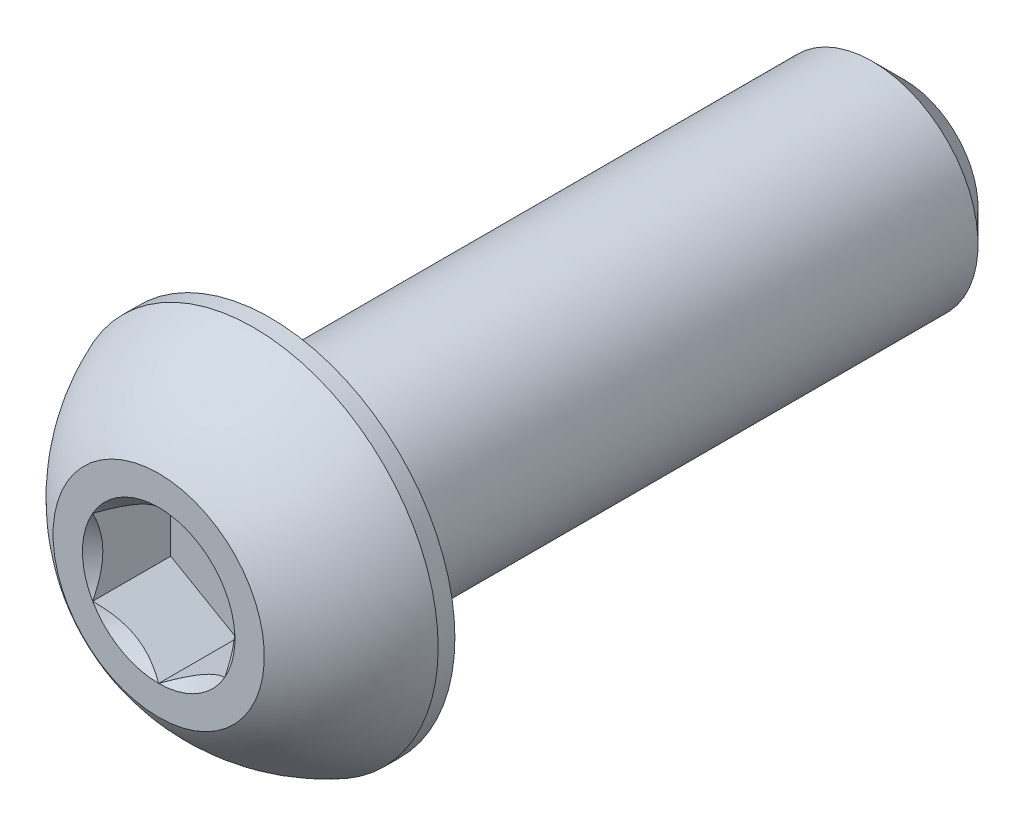
ISO-10303-21;
HEADER;
FILE_DESCRIPTION(('STEP AP214'),'2;1');
FILE_NAME('part.step','',(''),(''),'','','');
FILE_SCHEMA(('AUTOMOTIVE_DESIGN { 1 0 10303 214 1 1 1 1 }'));
ENDSEC;
DATA;
#1=APPLICATION_CONTEXT('core data for automotive mechanical design processes');
#2=APPLICATION_PROTOCOL_DEFINITION('international standard','automotive_design',2000,#1);
#3=PRODUCT_CONTEXT('',#1,'mechanical');
#4=PRODUCT('Part','Part','',(#3));
#5=PRODUCT_RELATED_PRODUCT_CATEGORY('part','',(#4));
#6=PRODUCT_DEFINITION_FORMATION('','',#4);
#7=PRODUCT_DEFINITION_CONTEXT('part definition',#1,'design');
#8=PRODUCT_DEFINITION('design','',#6,#7);
#9=PRODUCT_DEFINITION_SHAPE('','',#8);
#10=(LENGTH_UNIT() NAMED_UNIT(*) SI_UNIT(.MILLI.,.METRE.));
#11=(NAMED_UNIT(*) PLANE_ANGLE_UNIT() SI_UNIT($,.RADIAN.));
#12=(NAMED_UNIT(*) SI_UNIT($,.STERADIAN.) SOLID_ANGLE_UNIT());
#13=UNCERTAINTY_MEASURE_WITH_UNIT(LENGTH_MEASURE(1.E-05),#10,'distance_accuracy_value','');
#14=(GEOMETRIC_REPRESENTATION_CONTEXT(3) GLOBAL_UNCERTAINTY_ASSIGNED_CONTEXT((#13)) GLOBAL_UNIT_ASSIGNED_CONTEXT((#10,
#11,#12)) REPRESENTATION_CONTEXT('',''));
#15=CARTESIAN_POINT('',(0.,0.,0.));
#16=DIRECTION('',(0.,0.,1.));
#17=DIRECTION('',(1.,0.,0.));
#18=AXIS2_PLACEMENT_3D('',#15,#16,#17);
#19=CARTESIAN_POINT('',(0.,-3.175,-22.4028));
#20=DIRECTION('',(0.,0.,-1.));
#21=DIRECTION('',(0.,1.,0.));
#22=AXIS2_PLACEMENT_3D('',#19,#20,#21);
#23=PLANE('',#22);
#24=CARTESIAN_POINT('',(0.,0.,-22.4028));
#25=DIRECTION('',(0.,0.,-1.));
#26=DIRECTION('',(0.,1.,0.));
#27=AXIS2_PLACEMENT_3D('',#24,#25,#26);
#28=CIRCLE('',#27,2.22250000000001);
#29=CARTESIAN_POINT('',(0.,2.22250000000001,-22.4028));
#30=VERTEX_POINT('',#29);
#31=EDGE_CURVE('E177',#30,#30,#28,.T.);
#32=ORIENTED_EDGE('',*,*,#31,.T.);
#33=EDGE_LOOP('',(#32));
#34=FACE_BOUND('',#33,.T.);
#35=ADVANCED_FACE('F37',(#34),#23,.T.);
#36=CARTESIAN_POINT('',(0.,0.,-22.4028));
#37=DIRECTION('',(0.,0.,-1.));
#38=DIRECTION('',(0.,1.,0.));
#39=AXIS2_PLACEMENT_3D('',#36,#37,#38);
#40=CYLINDRICAL_SURFACE('',#39,3.175);
#41=CARTESIAN_POINT('',(0.,0.,-21.4503));
#42=DIRECTION('',(0.,0.,-1.));
#43=DIRECTION('',(0.,1.,0.));
#44=AXIS2_PLACEMENT_3D('',#41,#42,#43);
#45=CIRCLE('',#44,3.175);
#46=CARTESIAN_POINT('',(0.,3.175,-21.4503));
#47=VERTEX_POINT('',#46);
#48=EDGE_CURVE('E51',#47,#47,#45,.F.);
#49=ORIENTED_EDGE('',*,*,#48,.T.);
#50=EDGE_LOOP('',(#49));
#51=FACE_BOUND('',#50,.T.);
#52=CARTESIAN_POINT('',(0.,0.,-3.3528));
#53=DIRECTION('',(0.,0.,1.));
#54=DIRECTION('',(1.,0.,0.));
#55=AXIS2_PLACEMENT_3D('',#52,#53,#54);
#56=CIRCLE('',#55,3.175);
#57=CARTESIAN_POINT('',(3.175,0.,-3.3528));
#58=VERTEX_POINT('',#57);
#59=EDGE_CURVE('E174',#58,#58,#56,.F.);
#60=ORIENTED_EDGE('',*,*,#59,.T.);
#61=EDGE_LOOP('',(#60));
#62=FACE_BOUND('',#61,.T.);
#63=ADVANCED_FACE('F182',(#51,#62),#40,.T.);
#64=CARTESIAN_POINT('',(0.,0.,-22.4028));
#65=DIRECTION('',(0.,0.,1.));
#66=DIRECTION('',(0.,-1.,0.));
#67=AXIS2_PLACEMENT_3D('',#64,#65,#66);
#68=CONICAL_SURFACE('',#67,2.22250000000001,0.785398163397448);
#69=ORIENTED_EDGE('',*,*,#48,.F.);
#70=EDGE_LOOP('',(#69));
#71=FACE_BOUND('',#70,.T.);
#72=ORIENTED_EDGE('',*,*,#31,.F.);
#73=EDGE_LOOP('',(#72));
#74=FACE_BOUND('',#73,.T.);
#75=ADVANCED_FACE('F39',(#71,#74),#68,.T.);
#76=CARTESIAN_POINT('',(0.,0.,-5.060315));
#77=DIRECTION('',(0.,0.,1.));
#78=DIRECTION('',(0.,-1.,0.));
#79=AXIS2_PLACEMENT_3D('',#76,#77,#78);
#80=SPHERICAL_SURFACE('',#79,5.97389428256184);
#81=CARTESIAN_POINT('',(0.,0.,0.));
#82=DIRECTION('',(0.,0.,1.));
#83=DIRECTION('',(1.,0.,0.));
#84=AXIS2_PLACEMENT_3D('',#81,#82,#83);
#85=CIRCLE('',#84,3.175);
#86=CARTESIAN_POINT('',(0.,-3.175,0.));
#87=VERTEX_POINT('',#86);
#88=EDGE_CURVE('E171',#87,#87,#85,.T.);
#89=CARTESIAN_POINT('',(0.,0.,-2.84988));
#90=DIRECTION('',(0.,0.,1.));
#91=DIRECTION('',(1.,0.,0.));
#92=AXIS2_PLACEMENT_3D('',#89,#90,#91);
#93=CIRCLE('',#92,5.5499);
#94=CARTESIAN_POINT('',(0.,-5.5499,-2.84988));
#95=VERTEX_POINT('',#94);
#96=EDGE_CURVE('E165',#95,#95,#93,.T.);
#97=CARTESIAN_POINT('',(0.,-3.175,0.));
#98=CARTESIAN_POINT('',(0.,-3.20828343957184,-0.0208830076580502));
#99=CARTESIAN_POINT('',(0.,-3.24136078860705,-0.0420944789280503));
#100=CARTESIAN_POINT('',(0.,-3.30709055775141,-0.0851658910984718));
#101=CARTESIAN_POINT('',(0.,-3.33974297786056,-0.107025831998893));
#102=CARTESIAN_POINT('',(0.,-3.40461014130008,-0.151385725836676));
#103=CARTESIAN_POINT('',(0.,-3.43682488463043,-0.173885678774039));
#104=CARTESIAN_POINT('',(0.,-3.50080416139461,-0.219516822259479));
#105=CARTESIAN_POINT('',(0.,-3.53256869482844,-0.242648012807557));
#106=CARTESIAN_POINT('',(0.,-3.59563518208834,-0.289532629449102));
#107=CARTESIAN_POINT('',(0.,-3.62693713591442,-0.313286055542569));
#108=CARTESIAN_POINT('',(0.,-3.68906627753106,-0.36140589409133));
#109=CARTESIAN_POINT('',(0.,-3.71989346532163,-0.385772306546626));
#110=CARTESIAN_POINT('',(0.,-3.78106107243204,-0.435108631276877));
#111=CARTESIAN_POINT('',(0.,-3.8114014917519,-0.460078543551833));
#112=CARTESIAN_POINT('',(0.,-3.87158374923259,-0.510612146063938));
#113=CARTESIAN_POINT('',(0.,-3.90142558739343,-0.536175836301086));
#114=CARTESIAN_POINT('',(0.,-3.96059906392414,-0.587887041792083));
#115=CARTESIAN_POINT('',(0.,-3.989930702294,-0.614034557045931));
#116=CARTESIAN_POINT('',(0.,-4.04807235926832,-0.666903232293407));
#117=CARTESIAN_POINT('',(0.,-4.07688237787279,-0.693624392287034));
#118=CARTESIAN_POINT('',(0.,-4.13396957842491,-0.747629953401057));
#119=CARTESIAN_POINT('',(0.,-4.16224676037257,-0.774914354521453));
#120=CARTESIAN_POINT('',(0.,-4.21825727817542,-0.830035774981947));
#121=CARTESIAN_POINT('',(0.,-4.24599061403061,-0.857872794322045));
#122=CARTESIAN_POINT('',(0.,-4.30090264195357,-0.91408861315902));
#123=CARTESIAN_POINT('',(0.,-4.32808133402134,-0.942467412655899));
#124=CARTESIAN_POINT('',(0.,-4.38187349261953,-0.999755742806741));
#125=CARTESIAN_POINT('',(0.,-4.40848695914995,-1.0286652734607));
#126=CARTESIAN_POINT('',(0.,-4.46113830498838,-1.08700381029123));
#127=CARTESIAN_POINT('',(0.,-4.48717618429639,-1.11643281646778));
#128=CARTESIAN_POINT('',(0.,-4.53866621810402,-1.17579884645643));
#129=CARTESIAN_POINT('',(0.,-4.56411837260364,-1.20573587026853));
#130=CARTESIAN_POINT('',(0.,-4.61442704725457,-1.26610627984964));
#131=CARTESIAN_POINT('',(0.,-4.63928356740587,-1.29653966561866));
#132=CARTESIAN_POINT('',(0.,-4.68839129572448,-1.3578909501815));
#133=CARTESIAN_POINT('',(0.,-4.71264250389178,-1.38880884897531));
#134=CARTESIAN_POINT('',(0.,-4.76053016627881,-1.45111712201534));
#135=CARTESIAN_POINT('',(0.,-4.78416662049853,-1.48250749626155));
#136=CARTESIAN_POINT('',(0.,-4.8308155723751,-1.54574849868041));
#137=CARTESIAN_POINT('',(0.,-4.85382807003194,-1.57759912685306));
#138=CARTESIAN_POINT('',(0.,-4.89922014909859,-1.64174823640362));
#139=CARTESIAN_POINT('',(0.,-4.92159973050841,-1.67404671778154));
#140=CARTESIAN_POINT('',(0.,-4.96571726381658,-1.73907895865427));
#141=CARTESIAN_POINT('',(0.,-4.98745521571493,-1.77181271814908));
#142=CARTESIAN_POINT('',(0.,-5.03028102654719,-1.83770277069632));
#143=CARTESIAN_POINT('',(0.,-5.0513688854811,-1.87085906374874));
#144=CARTESIAN_POINT('',(0.,-5.09288630004063,-1.93758127434189));
#145=CARTESIAN_POINT('',(0.,-5.11331585566624,-1.97114719188261));
#146=CARTESIAN_POINT('',(0.,-5.15350870956168,-2.03867558290299));
#147=CARTESIAN_POINT('',(0.,-5.17327200783151,-2.07263805638265));
#148=CARTESIAN_POINT('',(0.,-5.21212465239608,-2.14094633632486));
#149=CARTESIAN_POINT('',(0.,-5.23121399869082,-2.17529214278741));
#150=CARTESIAN_POINT('',(0.,-5.26871130697935,-2.2443537165359));
#151=CARTESIAN_POINT('',(0.,-5.28711926897315,-2.27906948382184));
#152=CARTESIAN_POINT('',(0.,-5.32324664200827,-2.3488574628552));
#153=CARTESIAN_POINT('',(0.,-5.3409660530496,-2.38392967460262));
#154=CARTESIAN_POINT('',(0.,-5.37570942417474,-2.45441688802313));
#155=CARTESIAN_POINT('',(0.,-5.39273338425856,-2.48983188969622));
#156=CARTESIAN_POINT('',(0.,-5.42607922958184,-2.56099089271574));
#157=CARTESIAN_POINT('',(0.,-5.44240111482132,-2.59673489406217));
#158=CARTESIAN_POINT('',(0.,-5.47433643994316,-2.66853798649801));
#159=CARTESIAN_POINT('',(0.,-5.48994987982553,-2.70459707758742));
#160=CARTESIAN_POINT('',(0.,-5.52046229408188,-2.77701628549785));
#161=CARTESIAN_POINT('',(0.,-5.53536126845586,-2.81337640231887));
#162=CARTESIAN_POINT('',(0.,-5.5499,-2.84988));
#163=B_SPLINE_CURVE_WITH_KNOTS('',3,(#97,#98,#99,#100,#101,#102,#103,#104,#105,#106,#107,#108,
#109,#110,#111,#112,#113,#114,#115,#116,#117,#118,#119,#120,#121,#122,#123,#124,#125,#126,#127,
#128,#129,#130,#131,#132,#133,#134,#135,#136,#137,#138,#139,#140,#141,#142,#143,#144,#145,#146,
#147,#148,#149,#150,#151,#152,#153,#154,#155,#156,#157,#158,#159,#160,#161,#162),.UNSPECIFIED.,
.F.,.F.,(4,2,2,2,2,2,2,2,2,2,2,2,2,2,2,2,2,2,2,2,2,2,2,2,2,2,2,2,2,2,2,2,4),(0.,0.1178750807537,
0.235750161507399,0.353625242261099,0.471500323014798,0.589375403768498,0.707250484522198,
0.825125565275897,0.943000646029597,1.0608757267833,1.17875080753699,1.2966258882907,
1.41450096904439,1.53237604979809,1.65025113055179,1.76812621130549,1.88600129205919,
2.00387637281289,2.12175145356659,2.23962653432029,2.35750161507399,2.47537669582769,
2.59325177658139,2.71112685733509,2.82900193808879,2.94687701884249,3.06475209959619,
3.18262718034989,3.30050226110359,3.41837734185729,3.53625242261099,3.65412750336469,
3.77200258411839),.UNSPECIFIED.);
#164=EDGE_CURVE('BSEAM187',#87,#95,#163,.T.);
#165=ORIENTED_EDGE('',*,*,#88,.F.);
#166=ORIENTED_EDGE('',*,*,#96,.T.);
#167=ORIENTED_EDGE('',*,*,#164,.T.);
#168=ORIENTED_EDGE('',*,*,#164,.F.);
#169=EDGE_LOOP('',(#165,#167,#166,#168));
#170=FACE_BOUND('',#169,.T.);
#171=ADVANCED_FACE('F187',(#170),#80,.T.);
#172=CARTESIAN_POINT('',(0.,-3.175,0.));
#173=DIRECTION('',(0.,0.,-1.));
#174=DIRECTION('',(-1.,0.,0.));
#175=AXIS2_PLACEMENT_3D('',#172,#173,#174);
#176=PLANE('',#175);
#177=CARTESIAN_POINT('',(0.,0.,0.));
#178=DIRECTION('',(0.,0.,1.));
#179=DIRECTION('',(1.,0.,0.));
#180=AXIS2_PLACEMENT_3D('',#177,#178,#179);
#181=CIRCLE('',#180,2.29135888084633);
#182=CARTESIAN_POINT('',(-1.984375,1.14567944042316,0.));
#183=VERTEX_POINT('',#182);
#184=CARTESIAN_POINT('',(-1.984375,-1.14567944042316,0.));
#185=VERTEX_POINT('',#184);
#186=EDGE_CURVE('E64',#183,#185,#181,.T.);
#187=ORIENTED_EDGE('',*,*,#186,.F.);
#188=CARTESIAN_POINT('',(0.,2.29135888084633,0.));
#189=VERTEX_POINT('',#188);
#190=EDGE_CURVE('E136',#189,#183,#181,.T.);
#191=ORIENTED_EDGE('',*,*,#190,.F.);
#192=CARTESIAN_POINT('',(1.984375,1.14567944042316,0.));
#193=VERTEX_POINT('',#192);
#194=EDGE_CURVE('E133',#193,#189,#181,.T.);
#195=ORIENTED_EDGE('',*,*,#194,.F.);
#196=CARTESIAN_POINT('',(1.984375,-1.14567944042316,0.));
#197=VERTEX_POINT('',#196);
#198=EDGE_CURVE('E104',#197,#193,#181,.T.);
#199=ORIENTED_EDGE('',*,*,#198,.F.);
#200=CARTESIAN_POINT('',(0.,-2.29135888084633,0.));
#201=VERTEX_POINT('',#200);
#202=EDGE_CURVE('E96',#201,#197,#181,.T.);
#203=ORIENTED_EDGE('',*,*,#202,.F.);
#204=EDGE_CURVE('E57',#185,#201,#181,.T.);
#205=ORIENTED_EDGE('',*,*,#204,.F.);
#206=EDGE_LOOP('',(#187,#191,#195,#199,#203,#205));
#207=FACE_BOUND('',#206,.T.);
#208=ORIENTED_EDGE('',*,*,#88,.T.);
#209=EDGE_LOOP('',(#208));
#210=FACE_BOUND('',#209,.T.);
#211=ADVANCED_FACE('F130',(#207,#210),#176,.F.);
#212=CARTESIAN_POINT('',(0.,-5.5499,-3.3528));
#213=DIRECTION('',(0.,0.,1.));
#214=DIRECTION('',(1.,0.,0.));
#215=AXIS2_PLACEMENT_3D('',#212,#213,#214);
#216=PLANE('',#215);
#217=ORIENTED_EDGE('',*,*,#59,.F.);
#218=EDGE_LOOP('',(#217));
#219=FACE_BOUND('',#218,.T.);
#220=CARTESIAN_POINT('',(0.,0.,-3.3528));
#221=DIRECTION('',(0.,0.,1.));
#222=DIRECTION('',(1.,0.,0.));
#223=AXIS2_PLACEMENT_3D('',#220,#221,#222);
#224=CIRCLE('',#223,5.5499);
#225=CARTESIAN_POINT('',(5.5499,0.,-3.3528));
#226=VERTEX_POINT('',#225);
#227=EDGE_CURVE('E168',#226,#226,#224,.T.);
#228=ORIENTED_EDGE('',*,*,#227,.F.);
#229=EDGE_LOOP('',(#228));
#230=FACE_BOUND('',#229,.T.);
#231=ADVANCED_FACE('F201',(#219,#230),#216,.F.);
#232=CARTESIAN_POINT('',(0.,0.,0.));
#233=DIRECTION('',(0.,0.,1.));
#234=DIRECTION('',(1.,0.,0.));
#235=AXIS2_PLACEMENT_3D('',#232,#233,#234);
#236=CYLINDRICAL_SURFACE('',#235,5.5499);
#237=ORIENTED_EDGE('',*,*,#96,.F.);
#238=EDGE_LOOP('',(#237));
#239=FACE_BOUND('',#238,.T.);
#240=ORIENTED_EDGE('',*,*,#227,.T.);
#241=EDGE_LOOP('',(#240));
#242=FACE_BOUND('',#241,.T.);
#243=ADVANCED_FACE('F204',(#239,#242),#236,.T.);
#244=CARTESIAN_POINT('',(0.,0.,0.));
#245=DIRECTION('',(0.,0.,1.));
#246=DIRECTION('',(1.,0.,0.));
#247=AXIS2_PLACEMENT_3D('',#244,#245,#246);
#248=CONICAL_SURFACE('',#247,2.29135888084633,0.78539816339745);
#249=ORIENTED_EDGE('',*,*,#198,.T.);
#250=CARTESIAN_POINT('',(1.984375,-2.28495242157822,0.734984078816568));
#251=CARTESIAN_POINT('',(1.984375,-2.22931635455402,0.692986685550762));
#252=CARTESIAN_POINT('',(1.984375,-2.17336876548389,0.651396054076336));
#253=CARTESIAN_POINT('',(1.984375,-2.06072770258171,0.569208461471479));
#254=CARTESIAN_POINT('',(1.984375,-2.00403404503435,0.528611752405042));
#255=CARTESIAN_POINT('',(1.984375,-1.88936329173488,0.448303503174668));
#256=CARTESIAN_POINT('',(1.984375,-1.83137965519348,0.408601258813307));
#257=CARTESIAN_POINT('',(1.984375,-1.7144280213784,0.330685173401292));
#258=CARTESIAN_POINT('',(1.984375,-1.65546009407228,0.292471227194368));
#259=CARTESIAN_POINT('',(1.984375,-1.47005472306035,0.176252834013637));
#260=CARTESIAN_POINT('',(1.984375,-1.34163909427883,0.101347886872381));
#261=CARTESIAN_POINT('',(1.984375,-1.0784038470548,-0.0356697845602627));
#262=CARTESIAN_POINT('',(1.984375,-0.943607781407424,-0.0978256335176254));
#263=CARTESIAN_POINT('',(1.984375,-0.741275100444881,-0.173867421311381));
#264=CARTESIAN_POINT('',(1.984375,-0.676735408881095,-0.195691938673995));
#265=CARTESIAN_POINT('',(1.984375,-0.546098118112761,-0.234159536462205));
#266=CARTESIAN_POINT('',(1.984375,-0.480000411919955,-0.250802259934452));
#267=CARTESIAN_POINT('',(1.984375,-0.347746170028531,-0.277764619130277));
#268=CARTESIAN_POINT('',(1.984375,-0.281612071479122,-0.288192590264109));
#269=CARTESIAN_POINT('',(1.984375,-0.14863662005235,-0.302521852623404));
#270=CARTESIAN_POINT('',(1.984375,-0.0817953907393235,-0.306424265772614));
#271=CARTESIAN_POINT('',(1.984375,0.0495156750890644,-0.307412948667327));
#272=CARTESIAN_POINT('',(1.984375,0.113983775102991,-0.304740821124985));
#273=CARTESIAN_POINT('',(1.984375,0.242367515846177,-0.293260789502485));
#274=CARTESIAN_POINT('',(1.984375,0.30628310229592,-0.284452289360786));
#275=CARTESIAN_POINT('',(1.984375,0.434181040262184,-0.261030978667103));
#276=CARTESIAN_POINT('',(1.984375,0.498145026858309,-0.246319393767914));
#277=CARTESIAN_POINT('',(1.984375,0.624675616953007,-0.211873818587874));
#278=CARTESIAN_POINT('',(1.984375,0.687242336899689,-0.192140248550805));
#279=CARTESIAN_POINT('',(1.984375,0.884225483826088,-0.12258776276924));
#280=CARTESIAN_POINT('',(1.984375,1.01583674256468,-0.0648475887435034));
#281=CARTESIAN_POINT('',(1.984375,1.27288659242652,0.063530336588798));
#282=CARTESIAN_POINT('',(1.984375,1.3983008827048,0.134214424919413));
#283=CARTESIAN_POINT('',(1.984375,1.57956687990221,0.244516663813199));
#284=CARTESIAN_POINT('',(1.984375,1.63738271299424,0.280969829475364));
#285=CARTESIAN_POINT('',(1.984375,1.75202215386202,0.355415963291705));
#286=CARTESIAN_POINT('',(1.984375,1.80884568601362,0.393409048078054));
#287=CARTESIAN_POINT('',(1.984375,1.92116923084255,0.470338808893091));
#288=CARTESIAN_POINT('',(1.984375,1.97667624512253,0.509265313038791));
#289=CARTESIAN_POINT('',(1.984375,2.08693170717166,0.588147746121386));
#290=CARTESIAN_POINT('',(1.984375,2.14168035934793,0.62810338902403));
#291=CARTESIAN_POINT('',(1.984375,2.19611149046622,0.668480611285427));
#292=B_SPLINE_CURVE_WITH_KNOTS('',3,(#250,#251,#252,#253,#254,#255,#256,#257,#258,#259,#260,
#261,#262,#263,#264,#265,#266,#267,#268,#269,#270,#271,#272,#273,#274,#275,#276,#277,#278,#279,
#280,#281,#282,#283,#284,#285,#286,#287,#288,#289,#290,#291),.UNSPECIFIED.,.F.,.F.,(4,2,2,2,2,2,
2,2,2,2,2,2,2,2,2,2,2,2,2,2,4),(0.,0.209126070008322,0.418304637356569,0.629103979977992,
0.839888401371185,1.28549951116127,1.72957750768351,1.93379389749971,2.13802435186698,
2.33858179514334,2.53910475350639,2.73236963400794,2.92565329006887,3.12231577097487,
3.31896180041345,3.74886295245172,4.18033428125362,4.3853601718029,4.59040161996383,
4.79377749165108,4.99709743524131),.UNSPECIFIED.);
#293=EDGE_CURVE('E11',#197,#193,#292,.T.);
#294=ORIENTED_EDGE('',*,*,#293,.F.);
#295=EDGE_LOOP('',(#249,#294));
#296=FACE_BOUND('',#295,.T.);
#297=ADVANCED_FACE('F108',(#296),#248,.F.);
#298=ORIENTED_EDGE('',*,*,#194,.T.);
#299=CARTESIAN_POINT('',(1.984575,1.14556397036933,0.000115478781843379));
#300=CARTESIAN_POINT('',(1.9163590048332,1.18494849354192,-0.0392371477360855));
#301=CARTESIAN_POINT('',(1.84700231489303,1.22499159714897,-0.0762786895538155));
#302=CARTESIAN_POINT('',(1.70557619954781,1.30664400291398,-0.144101141576677));
#303=CARTESIAN_POINT('',(1.63349332126322,1.34826107209555,-0.174844310908246));
#304=CARTESIAN_POINT('',(1.488141602734,1.43217992591557,-0.227508111188786));
#305=CARTESIAN_POINT('',(1.41490978751306,1.47446033414663,-0.249561124120036));
#306=CARTESIAN_POINT('',(1.26683381740529,1.55995203534886,-0.283538507056124));
#307=CARTESIAN_POINT('',(1.19199418724658,1.60316071596705,-0.295488243908271));
#308=CARTESIAN_POINT('',(1.06301458545618,1.6776271237807,-0.306269900918094));
#309=CARTESIAN_POINT('',(1.00904128422756,1.7087886237741,-0.30786610094093));
#310=CARTESIAN_POINT('',(0.901182881480199,1.77106070163465,-0.305178161134708));
#311=CARTESIAN_POINT('',(0.847297817514476,1.80217125782056,-0.300891959659541));
#312=CARTESIAN_POINT('',(0.740036461751395,1.86409863044402,-0.286683126986481));
#313=CARTESIAN_POINT('',(0.686660807239859,1.89491507894443,-0.276754189547727));
#314=CARTESIAN_POINT('',(0.580832482591103,1.95601509066828,-0.251804915725461));
#315=CARTESIAN_POINT('',(0.528379742028898,1.9862986945516,-0.236784969610512));
#316=CARTESIAN_POINT('',(0.394017661036351,2.06387267818152,-0.19219214836433));
#317=CARTESIAN_POINT('',(0.312941642841675,2.11068193911104,-0.159257004061667));
#318=CARTESIAN_POINT('',(0.19372669327016,2.17951072233758,-0.103657558797803));
#319=CARTESIAN_POINT('',(0.154440075613998,2.20219286161692,-0.0841224079481375));
#320=CARTESIAN_POINT('',(0.0765946381319467,2.24713694590237,-0.0432712618805984));
#321=CARTESIAN_POINT('',(0.0380353888983008,2.26939913882716,-0.0219563604316496));
#322=CARTESIAN_POINT('',(-0.00020000000000058,2.29147435090017,0.000115478781842942));
#323=B_SPLINE_CURVE_WITH_KNOTS('',3,(#299,#300,#301,#302,#303,#304,#305,#306,#307,#308,#309,
#310,#311,#312,#313,#314,#315,#316,#317,#318,#319,#320,#321,#322),.UNSPECIFIED.,.F.,.F.,(4,2,2,
2,2,2,2,2,2,2,2,4),(0.,0.264339630306627,0.530219665093694,0.79187641637146,1.05287424418109,
1.239639843932,1.42647091743852,1.61351120244035,1.8005371524754,2.09764209964316,
2.24579179873714,2.39385111134157),.UNSPECIFIED.);
#324=EDGE_CURVE('E135',#193,#189,#323,.T.);
#325=ORIENTED_EDGE('',*,*,#324,.F.);
#326=EDGE_LOOP('',(#298,#325));
#327=FACE_BOUND('',#326,.T.);
#328=ADVANCED_FACE('F289',(#327),#248,.F.);
#329=ORIENTED_EDGE('',*,*,#190,.T.);
#330=CARTESIAN_POINT('',(0.000199999999999608,2.29147435090017,0.000115478781843248));
#331=CARTESIAN_POINT('',(-0.0680159951668025,2.25208982772757,-0.0392371477360854));
#332=CARTESIAN_POINT('',(-0.137372685106966,2.21204672412052,-0.0762786895538155));
#333=CARTESIAN_POINT('',(-0.278798800452188,2.13039431835551,-0.144101141576677));
#334=CARTESIAN_POINT('',(-0.350881678736783,2.08877724917394,-0.174844310908246));
#335=CARTESIAN_POINT('',(-0.496233397266004,2.00485839535392,-0.227508111188786));
#336=CARTESIAN_POINT('',(-0.569465212486939,1.96257798712287,-0.249561124120036));
#337=CARTESIAN_POINT('',(-0.717541182594707,1.87708628592063,-0.283538507056124));
#338=CARTESIAN_POINT('',(-0.792380812753425,1.83387760530244,-0.295488243908272));
#339=CARTESIAN_POINT('',(-0.921360414543816,1.75941119748879,-0.306269900918094));
#340=CARTESIAN_POINT('',(-0.975333715772443,1.72824969749539,-0.307866100940931));
#341=CARTESIAN_POINT('',(-1.0831921185198,1.66597761963484,-0.305178161134708));
#342=CARTESIAN_POINT('',(-1.13707718248552,1.63486706344893,-0.300891959659541));
#343=CARTESIAN_POINT('',(-1.2443385382486,1.57293969082547,-0.286683126986481));
#344=CARTESIAN_POINT('',(-1.29771419276014,1.54212324232506,-0.276754189547727));
#345=CARTESIAN_POINT('',(-1.4035425174089,1.48102323060122,-0.251804915725462));
#346=CARTESIAN_POINT('',(-1.4559952579711,1.45073962671789,-0.236784969610512));
#347=CARTESIAN_POINT('',(-1.59035733896365,1.37316564308797,-0.19219214836433));
#348=CARTESIAN_POINT('',(-1.67143335715832,1.32635638215845,-0.159257004061668));
#349=CARTESIAN_POINT('',(-1.79064830672984,1.25752759893191,-0.103657558797804));
#350=CARTESIAN_POINT('',(-1.829934924386,1.23484545965257,-0.0841224079481378));
#351=CARTESIAN_POINT('',(-1.90778036186805,1.18990137536712,-0.0432712618805986));
#352=CARTESIAN_POINT('',(-1.9463396111017,1.16763918244233,-0.0219563604316498));
#353=CARTESIAN_POINT('',(-1.984575,1.14556397036933,0.000115478781842511));
#354=B_SPLINE_CURVE_WITH_KNOTS('',3,(#330,#331,#332,#333,#334,#335,#336,#337,#338,#339,#340,
#341,#342,#343,#344,#345,#346,#347,#348,#349,#350,#351,#352,#353),.UNSPECIFIED.,.F.,.F.,(4,2,2,
2,2,2,2,2,2,2,2,4),(0.,0.264339630306627,0.530219665093694,0.791876416371461,1.05287424418109,
1.239639843932,1.42647091743852,1.61351120244035,1.8005371524754,2.09764209964316,
2.24579179873714,2.39385111134157),.UNSPECIFIED.);
#355=EDGE_CURVE('E140',#189,#183,#354,.T.);
#356=ORIENTED_EDGE('',*,*,#355,.F.);
#357=EDGE_LOOP('',(#329,#356));
#358=FACE_BOUND('',#357,.T.);
#359=ADVANCED_FACE('F143',(#358),#248,.F.);
#360=ORIENTED_EDGE('',*,*,#186,.T.);
#361=CARTESIAN_POINT('',(-1.984375,-2.28495242157823,0.734984078816569));
#362=CARTESIAN_POINT('',(-1.984375,-2.22931635455402,0.692986685550762));
#363=CARTESIAN_POINT('',(-1.984375,-2.17336876548389,0.651396054076336));
#364=CARTESIAN_POINT('',(-1.984375,-2.06072770258171,0.56920846147148));
#365=CARTESIAN_POINT('',(-1.984375,-2.00403404503435,0.528611752405043));
#366=CARTESIAN_POINT('',(-1.984375,-1.88936329173489,0.448303503174669));
#367=CARTESIAN_POINT('',(-1.984375,-1.83137965519348,0.408601258813308));
#368=CARTESIAN_POINT('',(-1.984375,-1.7144280213784,0.330685173401292));
#369=CARTESIAN_POINT('',(-1.984375,-1.65546009407228,0.292471227194368));
#370=CARTESIAN_POINT('',(-1.984375,-1.47005472306035,0.176252834013636));
#371=CARTESIAN_POINT('',(-1.984375,-1.34163909427883,0.101347886872382));
#372=CARTESIAN_POINT('',(-1.984375,-1.0784038470548,-0.0356697845602624));
#373=CARTESIAN_POINT('',(-1.984375,-0.943607781407425,-0.0978256335176256));
#374=CARTESIAN_POINT('',(-1.984375,-0.741275100444882,-0.173867421311381));
#375=CARTESIAN_POINT('',(-1.984375,-0.676735408881095,-0.195691938673995));
#376=CARTESIAN_POINT('',(-1.984375,-0.546098118112762,-0.234159536462205));
#377=CARTESIAN_POINT('',(-1.984375,-0.480000411919956,-0.250802259934452));
#378=CARTESIAN_POINT('',(-1.984375,-0.347746170028532,-0.277764619130277));
#379=CARTESIAN_POINT('',(-1.984375,-0.281612071479123,-0.288192590264108));
#380=CARTESIAN_POINT('',(-1.984375,-0.14863662005235,-0.302521852623404));
#381=CARTESIAN_POINT('',(-1.984375,-0.0817953907393237,-0.306424265772614));
#382=CARTESIAN_POINT('',(-1.984375,0.0495156750890643,-0.307412948667328));
#383=CARTESIAN_POINT('',(-1.984375,0.113983775102991,-0.304740821124985));
#384=CARTESIAN_POINT('',(-1.984375,0.242367515846177,-0.293260789502485));
#385=CARTESIAN_POINT('',(-1.984375,0.306283102295919,-0.284452289360786));
#386=CARTESIAN_POINT('',(-1.984375,0.434181040262184,-0.261030978667103));
#387=CARTESIAN_POINT('',(-1.984375,0.498145026858309,-0.246319393767914));
#388=CARTESIAN_POINT('',(-1.984375,0.624675616953007,-0.211873818587874));
#389=CARTESIAN_POINT('',(-1.984375,0.687242336899689,-0.192140248550805));
#390=CARTESIAN_POINT('',(-1.984375,0.884225483826087,-0.12258776276924));
#391=CARTESIAN_POINT('',(-1.984375,1.01583674256468,-0.0648475887435036));
#392=CARTESIAN_POINT('',(-1.984375,1.27288659242652,0.0635303365887976));
#393=CARTESIAN_POINT('',(-1.984375,1.3983008827048,0.134214424919412));
#394=CARTESIAN_POINT('',(-1.984375,1.57956687990221,0.244516663813198));
#395=CARTESIAN_POINT('',(-1.984375,1.63738271299424,0.280969829475363));
#396=CARTESIAN_POINT('',(-1.984375,1.75202215386202,0.355415963291704));
#397=CARTESIAN_POINT('',(-1.984375,1.80884568601362,0.393409048078054));
#398=CARTESIAN_POINT('',(-1.984375,1.92116923084255,0.47033880889309));
#399=CARTESIAN_POINT('',(-1.984375,1.97667624512253,0.509265313038791));
#400=CARTESIAN_POINT('',(-1.984375,2.08693170717166,0.588147746121386));
#401=CARTESIAN_POINT('',(-1.984375,2.14168035934793,0.628103389024029));
#402=CARTESIAN_POINT('',(-1.984375,2.19611149046622,0.668480611285426));
#403=B_SPLINE_CURVE_WITH_KNOTS('',3,(#361,#362,#363,#364,#365,#366,#367,#368,#369,#370,#371,
#372,#373,#374,#375,#376,#377,#378,#379,#380,#381,#382,#383,#384,#385,#386,#387,#388,#389,#390,
#391,#392,#393,#394,#395,#396,#397,#398,#399,#400,#401,#402),.UNSPECIFIED.,.F.,.F.,(4,2,2,2,2,2,
2,2,2,2,2,2,2,2,2,2,2,2,2,2,4),(0.,0.209126070008322,0.41830463735657,0.629103979977993,
0.839888401371186,1.28549951116127,1.72957750768351,1.93379389749972,2.13802435186698,
2.33858179514334,2.53910475350639,2.73236963400794,2.92565329006887,3.12231577097488,
3.31896180041345,3.74886295245172,4.18033428125362,4.3853601718029,4.59040161996383,
4.79377749165108,4.99709743524131),.UNSPECIFIED.);
#404=EDGE_CURVE('E147',#183,#185,#403,.F.);
#405=ORIENTED_EDGE('',*,*,#404,.F.);
#406=EDGE_LOOP('',(#360,#405));
#407=FACE_BOUND('',#406,.T.);
#408=ADVANCED_FACE('F283',(#407),#248,.F.);
#409=ORIENTED_EDGE('',*,*,#204,.T.);
#410=CARTESIAN_POINT('',(-1.984575,-1.14556397036933,0.000115478781843379));
#411=CARTESIAN_POINT('',(-1.9163590048332,-1.18494849354192,-0.0392371477360847));
#412=CARTESIAN_POINT('',(-1.84700231489303,-1.22499159714897,-0.0762786895538149));
#413=CARTESIAN_POINT('',(-1.70557619954781,-1.30664400291398,-0.144101141576677));
#414=CARTESIAN_POINT('',(-1.63349332126322,-1.34826107209555,-0.174844310908247));
#415=CARTESIAN_POINT('',(-1.488141602734,-1.43217992591557,-0.227508111188786));
#416=CARTESIAN_POINT('',(-1.41490978751306,-1.47446033414663,-0.249561124120036));
#417=CARTESIAN_POINT('',(-1.26683381740529,-1.55995203534886,-0.283538507056124));
#418=CARTESIAN_POINT('',(-1.19199418724658,-1.60316071596705,-0.295488243908271));
#419=CARTESIAN_POINT('',(-1.06301458545618,-1.6776271237807,-0.306269900918094));
#420=CARTESIAN_POINT('',(-1.00904128422756,-1.7087886237741,-0.30786610094093));
#421=CARTESIAN_POINT('',(-0.9011828814802,-1.77106070163465,-0.305178161134707));
#422=CARTESIAN_POINT('',(-0.847297817514477,-1.80217125782056,-0.30089195965954));
#423=CARTESIAN_POINT('',(-0.740036461751396,-1.86409863044402,-0.286683126986481));
#424=CARTESIAN_POINT('',(-0.68666080723986,-1.89491507894443,-0.276754189547727));
#425=CARTESIAN_POINT('',(-0.580832482591103,-1.95601509066828,-0.251804915725461));
#426=CARTESIAN_POINT('',(-0.528379742028898,-1.9862986945516,-0.236784969610511));
#427=CARTESIAN_POINT('',(-0.394017661036351,-2.06387267818152,-0.19219214836433));
#428=CARTESIAN_POINT('',(-0.312941642841675,-2.11068193911104,-0.159257004061667));
#429=CARTESIAN_POINT('',(-0.19372669327016,-2.17951072233758,-0.103657558797803));
#430=CARTESIAN_POINT('',(-0.154440075613998,-2.20219286161692,-0.0841224079481371));
#431=CARTESIAN_POINT('',(-0.0765946381319465,-2.24713694590237,-0.0432712618805977));
#432=CARTESIAN_POINT('',(-0.0380353888983009,-2.26939913882716,-0.0219563604316487));
#433=CARTESIAN_POINT('',(0.000200000000000425,-2.29147435090017,0.000115478781843735));
#434=B_SPLINE_CURVE_WITH_KNOTS('',3,(#410,#411,#412,#413,#414,#415,#416,#417,#418,#419,#420,
#421,#422,#423,#424,#425,#426,#427,#428,#429,#430,#431,#432,#433),.UNSPECIFIED.,.F.,.F.,(4,2,2,
2,2,2,2,2,2,2,2,4),(0.,0.264339630306627,0.530219665093694,0.79187641637146,1.05287424418109,
1.239639843932,1.42647091743852,1.61351120244035,1.8005371524754,2.09764209964316,
2.24579179873714,2.39385111134157),.UNSPECIFIED.);
#435=EDGE_CURVE('E120',#185,#201,#434,.T.);
#436=ORIENTED_EDGE('',*,*,#435,.F.);
#437=EDGE_LOOP('',(#409,#436));
#438=FACE_BOUND('',#437,.T.);
#439=ADVANCED_FACE('F231',(#438),#248,.F.);
#440=ORIENTED_EDGE('',*,*,#202,.T.);
#441=CARTESIAN_POINT('',(-0.000199999999999594,-2.29147435090017,0.000115478781843681));
#442=CARTESIAN_POINT('',(0.0680159951668032,-2.25208982772757,-0.0392371477360843));
#443=CARTESIAN_POINT('',(0.137372685106967,-2.21204672412052,-0.0762786895538144));
#444=CARTESIAN_POINT('',(0.278798800452188,-2.13039431835551,-0.144101141576676));
#445=CARTESIAN_POINT('',(0.350881678736783,-2.08877724917394,-0.174844310908246));
#446=CARTESIAN_POINT('',(0.496233397266004,-2.00485839535392,-0.227508111188787));
#447=CARTESIAN_POINT('',(0.569465212486939,-1.96257798712287,-0.249561124120036));
#448=CARTESIAN_POINT('',(0.717541182594707,-1.87708628592063,-0.283538507056124));
#449=CARTESIAN_POINT('',(0.792380812753425,-1.83387760530244,-0.295488243908272));
#450=CARTESIAN_POINT('',(0.921360414543816,-1.75941119748879,-0.306269900918094));
#451=CARTESIAN_POINT('',(0.975333715772443,-1.72824969749539,-0.30786610094093));
#452=CARTESIAN_POINT('',(1.0831921185198,-1.66597761963484,-0.305178161134708));
#453=CARTESIAN_POINT('',(1.13707718248552,-1.63486706344893,-0.300891959659541));
#454=CARTESIAN_POINT('',(1.2443385382486,-1.57293969082547,-0.286683126986481));
#455=CARTESIAN_POINT('',(1.29771419276014,-1.54212324232506,-0.276754189547727));
#456=CARTESIAN_POINT('',(1.4035425174089,-1.48102323060122,-0.251804915725462));
#457=CARTESIAN_POINT('',(1.4559952579711,-1.45073962671789,-0.236784969610512));
#458=CARTESIAN_POINT('',(1.59035733896365,-1.37316564308797,-0.19219214836433));
#459=CARTESIAN_POINT('',(1.67143335715832,-1.32635638215845,-0.159257004061668));
#460=CARTESIAN_POINT('',(1.79064830672984,-1.25752759893191,-0.103657558797804));
#461=CARTESIAN_POINT('',(1.829934924386,-1.23484545965257,-0.0841224079481379));
#462=CARTESIAN_POINT('',(1.90778036186805,-1.18990137536712,-0.0432712618805987));
#463=CARTESIAN_POINT('',(1.9463396111017,-1.16763918244233,-0.0219563604316498));
#464=CARTESIAN_POINT('',(1.984575,-1.14556397036933,0.000115478781842673));
#465=B_SPLINE_CURVE_WITH_KNOTS('',3,(#441,#442,#443,#444,#445,#446,#447,#448,#449,#450,#451,
#452,#453,#454,#455,#456,#457,#458,#459,#460,#461,#462,#463,#464),.UNSPECIFIED.,.F.,.F.,(4,2,2,
2,2,2,2,2,2,2,2,4),(0.,0.264339630306627,0.530219665093695,0.791876416371461,1.05287424418109,
1.239639843932,1.42647091743852,1.61351120244035,1.8005371524754,2.09764209964316,
2.24579179873714,2.39385111134157),.UNSPECIFIED.);
#466=EDGE_CURVE('E100',#201,#197,#465,.T.);
#467=ORIENTED_EDGE('',*,*,#466,.F.);
#468=EDGE_LOOP('',(#440,#467));
#469=FACE_BOUND('',#468,.T.);
#470=ADVANCED_FACE('F98',(#469),#248,.F.);
#471=CARTESIAN_POINT('',(1.984375,-1.14567944042316,-2.34696));
#472=DIRECTION('',(0.,0.,1.));
#473=DIRECTION('',(1.,0.,0.));
#474=AXIS2_PLACEMENT_3D('',#471,#472,#473);
#475=PLANE('',#474);
#476=DIRECTION('',(0.866025403784438,0.5,0.));
#477=VECTOR('',#476,1.);
#478=CARTESIAN_POINT('',(0.,-2.29135888084633,-2.34696));
#479=LINE('',#478,#477);
#480=CARTESIAN_POINT('',(0.,-2.29135888084633,-2.34696));
#481=VERTEX_POINT('',#480);
#482=CARTESIAN_POINT('',(1.984375,-1.14567944042316,-2.34696));
#483=VERTEX_POINT('',#482);
#484=EDGE_CURVE('E119',#481,#483,#479,.T.);
#485=ORIENTED_EDGE('',*,*,#484,.T.);
#486=DIRECTION('',(0.,1.,0.));
#487=VECTOR('',#486,1.);
#488=CARTESIAN_POINT('',(1.984375,-1.14567944042316,-2.34696));
#489=LINE('',#488,#487);
#490=CARTESIAN_POINT('',(1.984375,1.14567944042316,-2.34696));
#491=VERTEX_POINT('',#490);
#492=EDGE_CURVE('E124',#483,#491,#489,.T.);
#493=ORIENTED_EDGE('',*,*,#492,.T.);
#494=DIRECTION('',(-0.866025403784439,0.5,0.));
#495=VECTOR('',#494,1.);
#496=CARTESIAN_POINT('',(1.984375,1.14567944042316,-2.34696));
#497=LINE('',#496,#495);
#498=CARTESIAN_POINT('',(0.,2.29135888084633,-2.34696));
#499=VERTEX_POINT('',#498);
#500=EDGE_CURVE('E273',#491,#499,#497,.T.);
#501=ORIENTED_EDGE('',*,*,#500,.T.);
#502=DIRECTION('',(-0.866025403784438,-0.5,0.));
#503=VECTOR('',#502,1.);
#504=CARTESIAN_POINT('',(0.,2.29135888084633,-2.34696));
#505=LINE('',#504,#503);
#506=CARTESIAN_POINT('',(-1.984375,1.14567944042316,-2.34696));
#507=VERTEX_POINT('',#506);
#508=EDGE_CURVE('E156',#499,#507,#505,.T.);
#509=ORIENTED_EDGE('',*,*,#508,.T.);
#510=DIRECTION('',(0.,-1.,0.));
#511=VECTOR('',#510,1.);
#512=CARTESIAN_POINT('',(-1.984375,1.14567944042316,-2.34696));
#513=LINE('',#512,#511);
#514=CARTESIAN_POINT('',(-1.984375,-1.14567944042316,-2.34696));
#515=VERTEX_POINT('',#514);
#516=EDGE_CURVE('E277',#507,#515,#513,.T.);
#517=ORIENTED_EDGE('',*,*,#516,.T.);
#518=DIRECTION('',(0.866025403784439,-0.5,0.));
#519=VECTOR('',#518,1.);
#520=CARTESIAN_POINT('',(-1.984375,-1.14567944042316,-2.34696));
#521=LINE('',#520,#519);
#522=EDGE_CURVE('E127',#515,#481,#521,.T.);
#523=ORIENTED_EDGE('',*,*,#522,.T.);
#524=EDGE_LOOP('',(#485,#493,#501,#509,#517,#523));
#525=FACE_BOUND('',#524,.T.);
#526=ADVANCED_FACE('F230',(#525),#475,.T.);
#527=CARTESIAN_POINT('',(1.984375,-1.14567944042316,-2.34696));
#528=DIRECTION('',(1.,0.,0.));
#529=DIRECTION('',(0.,0.,-1.));
#530=AXIS2_PLACEMENT_3D('',#527,#528,#529);
#531=PLANE('',#530);
#532=DIRECTION('',(0.,0.,1.));
#533=VECTOR('',#532,1.);
#534=CARTESIAN_POINT('',(1.984375,-1.14567944042316,-2.34696));
#535=LINE('',#534,#533);
#536=EDGE_CURVE('E116',#483,#197,#535,.T.);
#537=ORIENTED_EDGE('',*,*,#536,.T.);
#538=ORIENTED_EDGE('',*,*,#293,.T.);
#539=DIRECTION('',(0.,0.,1.));
#540=VECTOR('',#539,1.);
#541=CARTESIAN_POINT('',(1.984375,1.14567944042316,-2.34696));
#542=LINE('',#541,#540);
#543=EDGE_CURVE('E126',#491,#193,#542,.T.);
#544=ORIENTED_EDGE('',*,*,#543,.F.);
#545=ORIENTED_EDGE('',*,*,#492,.F.);
#546=EDGE_LOOP('',(#537,#538,#544,#545));
#547=FACE_BOUND('',#546,.T.);
#548=ADVANCED_FACE('F122',(#547),#531,.F.);
#549=CARTESIAN_POINT('',(1.984375,1.14567944042316,-2.34696));
#550=DIRECTION('',(0.5,0.866025403784439,0.));
#551=DIRECTION('',(-0.866025403784439,0.5,0.));
#552=AXIS2_PLACEMENT_3D('',#549,#550,#551);
#553=PLANE('',#552);
#554=ORIENTED_EDGE('',*,*,#543,.T.);
#555=ORIENTED_EDGE('',*,*,#324,.T.);
#556=DIRECTION('',(0.,0.,1.));
#557=VECTOR('',#556,1.);
#558=CARTESIAN_POINT('',(0.,2.29135888084633,-2.34696));
#559=LINE('',#558,#557);
#560=EDGE_CURVE('E152',#499,#189,#559,.T.);
#561=ORIENTED_EDGE('',*,*,#560,.F.);
#562=ORIENTED_EDGE('',*,*,#500,.F.);
#563=EDGE_LOOP('',(#554,#555,#561,#562));
#564=FACE_BOUND('',#563,.T.);
#565=ADVANCED_FACE('F150',(#564),#553,.F.);
#566=CARTESIAN_POINT('',(0.,2.29135888084633,-2.34696));
#567=DIRECTION('',(-0.5,0.866025403784438,0.));
#568=DIRECTION('',(-0.866025403784438,-0.5,0.));
#569=AXIS2_PLACEMENT_3D('',#566,#567,#568);
#570=PLANE('',#569);
#571=ORIENTED_EDGE('',*,*,#560,.T.);
#572=ORIENTED_EDGE('',*,*,#355,.T.);
#573=DIRECTION('',(0.,0.,1.));
#574=VECTOR('',#573,1.);
#575=CARTESIAN_POINT('',(-1.984375,1.14567944042316,-2.34696));
#576=LINE('',#575,#574);
#577=EDGE_CURVE('E158',#507,#183,#576,.T.);
#578=ORIENTED_EDGE('',*,*,#577,.F.);
#579=ORIENTED_EDGE('',*,*,#508,.F.);
#580=EDGE_LOOP('',(#571,#572,#578,#579));
#581=FACE_BOUND('',#580,.T.);
#582=ADVANCED_FACE('F154',(#581),#570,.F.);
#583=CARTESIAN_POINT('',(-1.984375,1.14567944042316,-2.34696));
#584=DIRECTION('',(-1.,0.,0.));
#585=DIRECTION('',(0.,0.,1.));
#586=AXIS2_PLACEMENT_3D('',#583,#584,#585);
#587=PLANE('',#586);
#588=ORIENTED_EDGE('',*,*,#577,.T.);
#589=ORIENTED_EDGE('',*,*,#404,.T.);
#590=DIRECTION('',(0.,0.,1.));
#591=VECTOR('',#590,1.);
#592=CARTESIAN_POINT('',(-1.984375,-1.14567944042316,-2.34696));
#593=LINE('',#592,#591);
#594=EDGE_CURVE('E160',#515,#185,#593,.T.);
#595=ORIENTED_EDGE('',*,*,#594,.F.);
#596=ORIENTED_EDGE('',*,*,#516,.F.);
#597=EDGE_LOOP('',(#588,#589,#595,#596));
#598=FACE_BOUND('',#597,.T.);
#599=ADVANCED_FACE('F252',(#598),#587,.F.);
#600=CARTESIAN_POINT('',(-1.984375,-1.14567944042316,-2.34696));
#601=DIRECTION('',(-0.5,-0.866025403784439,0.));
#602=DIRECTION('',(0.866025403784439,-0.5,0.));
#603=AXIS2_PLACEMENT_3D('',#600,#601,#602);
#604=PLANE('',#603);
#605=ORIENTED_EDGE('',*,*,#594,.T.);
#606=ORIENTED_EDGE('',*,*,#435,.T.);
#607=DIRECTION('',(0.,0.,1.));
#608=VECTOR('',#607,1.);
#609=CARTESIAN_POINT('',(0.,-2.29135888084633,-2.34696));
#610=LINE('',#609,#608);
#611=EDGE_CURVE('E118',#481,#201,#610,.T.);
#612=ORIENTED_EDGE('',*,*,#611,.F.);
#613=ORIENTED_EDGE('',*,*,#522,.F.);
#614=EDGE_LOOP('',(#605,#606,#612,#613));
#615=FACE_BOUND('',#614,.T.);
#616=ADVANCED_FACE('F211',(#615),#604,.F.);
#617=CARTESIAN_POINT('',(0.,-2.29135888084633,-2.34696));
#618=DIRECTION('',(0.5,-0.866025403784438,0.));
#619=DIRECTION('',(0.866025403784438,0.5,0.));
#620=AXIS2_PLACEMENT_3D('',#617,#618,#619);
#621=PLANE('',#620);
#622=ORIENTED_EDGE('',*,*,#611,.T.);
#623=ORIENTED_EDGE('',*,*,#466,.T.);
#624=ORIENTED_EDGE('',*,*,#536,.F.);
#625=ORIENTED_EDGE('',*,*,#484,.F.);
#626=EDGE_LOOP('',(#622,#623,#624,#625));
#627=FACE_BOUND('',#626,.T.);
#628=ADVANCED_FACE('F114',(#627),#621,.F.);
#629=CLOSED_SHELL('',(#35,#63,#75,#171,#211,#231,#243,#297,#328,#359,#408,#439,#470,#526,#548,
#565,#582,#599,#616,#628));
#630=MANIFOLD_SOLID_BREP('B2',#629);
#631=ADVANCED_BREP_SHAPE_REPRESENTATION('',(#18,#630),#14);
#632=SHAPE_DEFINITION_REPRESENTATION(#9,#631);
ENDSEC;
END-ISO-10303-21;
